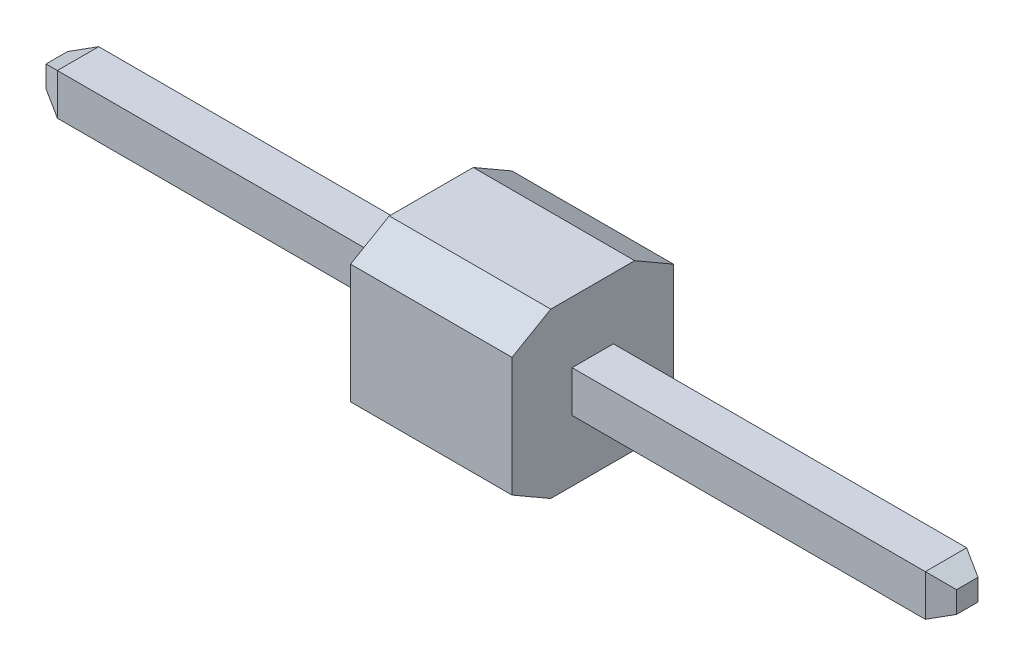
ISO-10303-21;
HEADER;
FILE_DESCRIPTION(('STEP AP214'),'2;1');
FILE_NAME('part.step','',(''),(''),'','','');
FILE_SCHEMA(('AUTOMOTIVE_DESIGN { 1 0 10303 214 1 1 1 1 }'));
ENDSEC;
DATA;
#1=APPLICATION_CONTEXT('core data for automotive mechanical design processes');
#2=APPLICATION_PROTOCOL_DEFINITION('international standard','automotive_design',2000,#1);
#3=PRODUCT_CONTEXT('',#1,'mechanical');
#4=PRODUCT('Part','Part','',(#3));
#5=PRODUCT_RELATED_PRODUCT_CATEGORY('part','',(#4));
#6=PRODUCT_DEFINITION_FORMATION('','',#4);
#7=PRODUCT_DEFINITION_CONTEXT('part definition',#1,'design');
#8=PRODUCT_DEFINITION('design','',#6,#7);
#9=PRODUCT_DEFINITION_SHAPE('','',#8);
#10=(LENGTH_UNIT() NAMED_UNIT(*) SI_UNIT(.MILLI.,.METRE.));
#11=(NAMED_UNIT(*) PLANE_ANGLE_UNIT() SI_UNIT($,.RADIAN.));
#12=(NAMED_UNIT(*) SI_UNIT($,.STERADIAN.) SOLID_ANGLE_UNIT());
#13=UNCERTAINTY_MEASURE_WITH_UNIT(LENGTH_MEASURE(1.E-05),#10,'distance_accuracy_value','');
#14=(GEOMETRIC_REPRESENTATION_CONTEXT(3) GLOBAL_UNCERTAINTY_ASSIGNED_CONTEXT((#13)) GLOBAL_UNIT_ASSIGNED_CONTEXT((#10,
#11,#12)) REPRESENTATION_CONTEXT('',''));
#15=CARTESIAN_POINT('',(0.,0.,0.));
#16=DIRECTION('',(0.,0.,1.));
#17=DIRECTION('',(1.,0.,0.));
#18=AXIS2_PLACEMENT_3D('',#15,#16,#17);
#19=CARTESIAN_POINT('',(5.42107561170757,-15.5571282629139,0.629998634255617));
#20=DIRECTION('',(1.,4.37113882867379E-08,-4.37113882867379E-08));
#21=DIRECTION('',(-4.37113882867379E-08,1.,0.));
#22=AXIS2_PLACEMENT_3D('',#19,#20,#21);
#23=PLANE('',#22);
#24=DIRECTION('',(1.59994777304464E-08,0.500000000000191,0.866025403784328));
#25=VECTOR('',#24,1.);
#26=CARTESIAN_POINT('',(5.42107548872165,-14.3135384244239,-0.940001365744382));
#27=LINE('',#26,#25);
#28=CARTESIAN_POINT('',(5.42107548872165,-14.3135384244239,-0.940001365744382));
#29=VERTEX_POINT('',#28);
#30=CARTESIAN_POINT('',(5.42107549980641,-13.9671282629139,-0.340001365744383));
#31=VERTEX_POINT('',#30);
#32=EDGE_CURVE('E11',#29,#31,#27,.T.);
#33=ORIENTED_EDGE('',*,*,#32,.T.);
#34=DIRECTION('',(4.37113880134522E-08,0.,0.999999999999999));
#35=VECTOR('',#34,1.);
#36=CARTESIAN_POINT('',(5.42107549980641,-13.9671282629139,-0.340001365744383));
#37=LINE('',#36,#35);
#38=CARTESIAN_POINT('',(5.42107555663122,-13.9671282629139,0.959998634255618));
#39=VERTEX_POINT('',#38);
#40=EDGE_CURVE('E304',#31,#39,#37,.T.);
#41=ORIENTED_EDGE('',*,*,#40,.T.);
#42=DIRECTION('',(5.97108681645513E-08,-0.500000000000186,0.866025403784329));
#43=VECTOR('',#42,1.);
#44=CARTESIAN_POINT('',(5.42107555663122,-13.9671282629139,0.959998634255618));
#45=LINE('',#44,#43);
#46=CARTESIAN_POINT('',(5.42107559800012,-14.3135384244239,1.55999863425562));
#47=VERTEX_POINT('',#46);
#48=EDGE_CURVE('E296',#39,#47,#45,.T.);
#49=ORIENTED_EDGE('',*,*,#48,.T.);
#50=DIRECTION('',(4.37113880007249E-08,-0.999999999999999,0.));
#51=VECTOR('',#50,1.);
#52=CARTESIAN_POINT('',(5.42107559800012,-14.3135384244239,1.55999863425562));
#53=LINE('',#52,#51);
#54=CARTESIAN_POINT('',(5.42107567874291,-16.1607181013939,1.55999863425562));
#55=VERTEX_POINT('',#54);
#56=EDGE_CURVE('E281',#47,#55,#53,.T.);
#57=ORIENTED_EDGE('',*,*,#56,.T.);
#58=DIRECTION('',(1.59994790123059E-08,0.500000000000195,0.866025403784326));
#59=VECTOR('',#58,1.);
#60=CARTESIAN_POINT('',(5.42107566765814,-16.5071282629139,0.959998634255618));
#61=LINE('',#60,#59);
#62=CARTESIAN_POINT('',(5.42107566765814,-16.5071282629139,0.959998634255618));
#63=VERTEX_POINT('',#62);
#64=EDGE_CURVE('E265',#63,#55,#61,.T.);
#65=ORIENTED_EDGE('',*,*,#64,.F.);
#66=DIRECTION('',(4.37113880134522E-08,0.,0.999999999999999));
#67=VECTOR('',#66,1.);
#68=CARTESIAN_POINT('',(5.42107561083334,-16.5071282629139,-0.340001365744383));
#69=LINE('',#68,#67);
#70=CARTESIAN_POINT('',(5.42107561083334,-16.5071282629139,-0.340001365744383));
#71=VERTEX_POINT('',#70);
#72=EDGE_CURVE('E248',#71,#63,#69,.T.);
#73=ORIENTED_EDGE('',*,*,#72,.F.);
#74=DIRECTION('',(5.97108668821451E-08,-0.500000000000186,0.866025403784329));
#75=VECTOR('',#74,1.);
#76=CARTESIAN_POINT('',(5.42107556946444,-16.1607181013939,-0.940001365744382));
#77=LINE('',#76,#75);
#78=CARTESIAN_POINT('',(5.42107556946444,-16.1607181013939,-0.940001365744382));
#79=VERTEX_POINT('',#78);
#80=EDGE_CURVE('E242',#79,#71,#77,.T.);
#81=ORIENTED_EDGE('',*,*,#80,.F.);
#82=DIRECTION('',(4.37113880007249E-08,-0.999999999999999,0.));
#83=VECTOR('',#82,1.);
#84=CARTESIAN_POINT('',(5.42107548872165,-14.3135384244239,-0.940001365744382));
#85=LINE('',#84,#83);
#86=EDGE_CURVE('E236',#29,#79,#85,.T.);
#87=ORIENTED_EDGE('',*,*,#86,.F.);
#88=EDGE_LOOP('',(#33,#41,#49,#57,#65,#73,#81,#87));
#89=FACE_BOUND('',#88,.T.);
#90=DIRECTION('',(-4.37113872875372E-08,0.,-0.999999999999999));
#91=VECTOR('',#90,1.);
#92=CARTESIAN_POINT('',(5.42107558373228,-14.9171282629139,0.629998634255617));
#93=LINE('',#92,#91);
#94=CARTESIAN_POINT('',(5.42107558373228,-14.9171282629139,0.629998634255617));
#95=VERTEX_POINT('',#94);
#96=CARTESIAN_POINT('',(5.42107555575699,-14.9171282629139,-0.0100013657443826));
#97=VERTEX_POINT('',#96);
#98=EDGE_CURVE('E302',#95,#97,#93,.T.);
#99=ORIENTED_EDGE('',*,*,#98,.T.);
#100=DIRECTION('',(-4.37113872875371E-08,0.999999999999999,0.));
#101=VECTOR('',#100,1.);
#102=CARTESIAN_POINT('',(5.42107558373228,-15.5571282629139,-0.0100013657443826));
#103=LINE('',#102,#101);
#104=CARTESIAN_POINT('',(5.42107558373228,-15.5571282629139,-0.0100013657443826));
#105=VERTEX_POINT('',#104);
#106=EDGE_CURVE('E293',#105,#97,#103,.T.);
#107=ORIENTED_EDGE('',*,*,#106,.F.);
#108=DIRECTION('',(-4.37113886753159E-08,0.,-0.999999999999999));
#109=VECTOR('',#108,1.);
#110=CARTESIAN_POINT('',(5.42107561170757,-15.5571282629139,0.629998634255617));
#111=LINE('',#110,#109);
#112=CARTESIAN_POINT('',(5.42107561170757,-15.5571282629139,0.629998634255617));
#113=VERTEX_POINT('',#112);
#114=EDGE_CURVE('E278',#113,#105,#111,.T.);
#115=ORIENTED_EDGE('',*,*,#114,.F.);
#116=DIRECTION('',(-4.37113886753159E-08,0.999999999999999,0.));
#117=VECTOR('',#116,1.);
#118=CARTESIAN_POINT('',(5.42107561170757,-15.5571282629139,0.629998634255617));
#119=LINE('',#118,#117);
#120=EDGE_CURVE('E263',#113,#95,#119,.T.);
#121=ORIENTED_EDGE('',*,*,#120,.T.);
#122=EDGE_LOOP('',(#99,#107,#115,#121));
#123=FACE_BOUND('',#122,.T.);
#124=ADVANCED_FACE('F17',(#89,#123),#23,.T.);
#125=CARTESIAN_POINT('',(2.92107561170757,-15.5571283721924,0.629998743534088));
#126=DIRECTION('',(1.,4.37113882867379E-08,-4.37113882867379E-08));
#127=DIRECTION('',(-4.37113882867379E-08,1.,0.));
#128=AXIS2_PLACEMENT_3D('',#125,#126,#127);
#129=PLANE('',#128);
#130=DIRECTION('',(1.59994783714339E-08,0.500000000000191,0.866025403784328));
#131=VECTOR('',#130,1.);
#132=CARTESIAN_POINT('',(2.92107548872165,-14.3135385337024,-0.940001256465912));
#133=LINE('',#132,#131);
#134=CARTESIAN_POINT('',(2.92107548872165,-14.3135385337024,-0.940001256465912));
#135=VERTEX_POINT('',#134);
#136=CARTESIAN_POINT('',(2.92107549980641,-13.9671283721924,-0.340001256465912));
#137=VERTEX_POINT('',#136);
#138=EDGE_CURVE('E24',#135,#137,#133,.T.);
#139=ORIENTED_EDGE('',*,*,#138,.F.);
#140=DIRECTION('',(4.37113882411396E-08,-0.999999999999999,0.));
#141=VECTOR('',#140,1.);
#142=CARTESIAN_POINT('',(2.92107548872165,-14.3135385337024,-0.940001256465912));
#143=LINE('',#142,#141);
#144=CARTESIAN_POINT('',(2.92107556946444,-16.1607182106724,-0.940001256465912));
#145=VERTEX_POINT('',#144);
#146=EDGE_CURVE('E300',#135,#145,#143,.T.);
#147=ORIENTED_EDGE('',*,*,#146,.T.);
#148=DIRECTION('',(5.97108668821451E-08,-0.500000000000186,0.866025403784329));
#149=VECTOR('',#148,1.);
#150=CARTESIAN_POINT('',(2.92107556946444,-16.1607182106724,-0.940001256465912));
#151=LINE('',#150,#149);
#152=CARTESIAN_POINT('',(2.92107561083334,-16.5071283721924,-0.340001256465912));
#153=VERTEX_POINT('',#152);
#154=EDGE_CURVE('E286',#145,#153,#151,.T.);
#155=ORIENTED_EDGE('',*,*,#154,.T.);
#156=DIRECTION('',(4.37113883550593E-08,0.,0.999999999999999));
#157=VECTOR('',#156,1.);
#158=CARTESIAN_POINT('',(2.92107561083334,-16.5071283721924,-0.340001256465912));
#159=LINE('',#158,#157);
#160=CARTESIAN_POINT('',(2.92107566765814,-16.5071283721924,0.959998743534088));
#161=VERTEX_POINT('',#160);
#162=EDGE_CURVE('E271',#153,#161,#159,.T.);
#163=ORIENTED_EDGE('',*,*,#162,.T.);
#164=DIRECTION('',(1.59994783713184E-08,0.500000000000195,0.866025403784326));
#165=VECTOR('',#164,1.);
#166=CARTESIAN_POINT('',(2.92107566765814,-16.5071283721924,0.959998743534088));
#167=LINE('',#166,#165);
#168=CARTESIAN_POINT('',(2.92107567874291,-16.1607182106724,1.55999874353409));
#169=VERTEX_POINT('',#168);
#170=EDGE_CURVE('E253',#161,#169,#167,.T.);
#171=ORIENTED_EDGE('',*,*,#170,.T.);
#172=DIRECTION('',(4.37113882411396E-08,-0.999999999999999,0.));
#173=VECTOR('',#172,1.);
#174=CARTESIAN_POINT('',(2.92107559800012,-14.3135385337024,1.55999874353409));
#175=LINE('',#174,#173);
#176=CARTESIAN_POINT('',(2.92107559800012,-14.3135385337024,1.55999874353409));
#177=VERTEX_POINT('',#176);
#178=EDGE_CURVE('E261',#177,#169,#175,.T.);
#179=ORIENTED_EDGE('',*,*,#178,.F.);
#180=DIRECTION('',(5.97108668825762E-08,-0.500000000000186,0.866025403784329));
#181=VECTOR('',#180,1.);
#182=CARTESIAN_POINT('',(2.92107555663122,-13.9671283721924,0.959998743534088));
#183=LINE('',#182,#181);
#184=CARTESIAN_POINT('',(2.92107555663122,-13.9671283721924,0.959998743534088));
#185=VERTEX_POINT('',#184);
#186=EDGE_CURVE('E276',#185,#177,#183,.T.);
#187=ORIENTED_EDGE('',*,*,#186,.F.);
#188=DIRECTION('',(4.37113883550593E-08,0.,0.999999999999999));
#189=VECTOR('',#188,1.);
#190=CARTESIAN_POINT('',(2.92107549980641,-13.9671283721924,-0.340001256465912));
#191=LINE('',#190,#189);
#192=EDGE_CURVE('E291',#137,#185,#191,.T.);
#193=ORIENTED_EDGE('',*,*,#192,.F.);
#194=EDGE_LOOP('',(#139,#147,#155,#163,#171,#179,#187,#193));
#195=FACE_BOUND('',#194,.T.);
#196=DIRECTION('',(-4.37113886753159E-08,0.999999999999999,0.));
#197=VECTOR('',#196,1.);
#198=CARTESIAN_POINT('',(2.92107558373228,-15.5571283721924,-0.0100012564659119));
#199=LINE('',#198,#197);
#200=CARTESIAN_POINT('',(2.92107558373228,-15.5571283721924,-0.0100012564659119));
#201=VERTEX_POINT('',#200);
#202=CARTESIAN_POINT('',(2.92107555575699,-14.9171283721924,-0.0100012564659119));
#203=VERTEX_POINT('',#202);
#204=EDGE_CURVE('E298',#201,#203,#199,.T.);
#205=ORIENTED_EDGE('',*,*,#204,.T.);
#206=DIRECTION('',(-4.37113886753159E-08,0.,-0.999999999999999));
#207=VECTOR('',#206,1.);
#208=CARTESIAN_POINT('',(2.92107558373228,-14.9171283721924,0.629998743534088));
#209=LINE('',#208,#207);
#210=CARTESIAN_POINT('',(2.92107558373228,-14.9171283721924,0.629998743534088));
#211=VERTEX_POINT('',#210);
#212=EDGE_CURVE('E283',#211,#203,#209,.T.);
#213=ORIENTED_EDGE('',*,*,#212,.F.);
#214=DIRECTION('',(-4.37113879814265E-08,0.999999999999999,0.));
#215=VECTOR('',#214,1.);
#216=CARTESIAN_POINT('',(2.92107561170757,-15.5571283721924,0.629998743534088));
#217=LINE('',#216,#215);
#218=CARTESIAN_POINT('',(2.92107561170757,-15.5571283721924,0.629998743534088));
#219=VERTEX_POINT('',#218);
#220=EDGE_CURVE('E268',#219,#211,#217,.T.);
#221=ORIENTED_EDGE('',*,*,#220,.F.);
#222=DIRECTION('',(-4.37113879814266E-08,0.,-0.999999999999999));
#223=VECTOR('',#222,1.);
#224=CARTESIAN_POINT('',(2.92107561170757,-15.5571283721924,0.629998743534088));
#225=LINE('',#224,#223);
#226=EDGE_CURVE('E251',#219,#201,#225,.T.);
#227=ORIENTED_EDGE('',*,*,#226,.T.);
#228=EDGE_LOOP('',(#205,#213,#221,#227));
#229=FACE_BOUND('',#228,.T.);
#230=ADVANCED_FACE('F314',(#195,#229),#129,.F.);
#231=CARTESIAN_POINT('',(5.42107548872165,-14.3135384244239,-0.940001365744382));
#232=DIRECTION('',(5.97108668343731E-08,-0.866025403784328,0.50000000000019));
#233=DIRECTION('',(-1.59994785476185E-08,-0.500000000000192,-0.866025403784329));
#234=AXIS2_PLACEMENT_3D('',#231,#232,#233);
#235=PLANE('',#234);
#236=ORIENTED_EDGE('',*,*,#138,.T.);
#237=DIRECTION('',(-0.999999999999998,-4.37113854445669E-08,4.37113883755557E-08));
#238=VECTOR('',#237,1.);
#239=CARTESIAN_POINT('',(5.42107549980641,-13.9671282629139,-0.340001365744383));
#240=LINE('',#239,#238);
#241=EDGE_CURVE('E288',#31,#137,#240,.T.);
#242=ORIENTED_EDGE('',*,*,#241,.F.);
#243=ORIENTED_EDGE('',*,*,#32,.F.);
#244=DIRECTION('',(-0.999999999999998,-4.37113897078233E-08,4.37113881091021E-08));
#245=VECTOR('',#244,1.);
#246=CARTESIAN_POINT('',(5.42107548872165,-14.3135384244239,-0.940001365744382));
#247=LINE('',#246,#245);
#248=EDGE_CURVE('E256',#29,#135,#247,.T.);
#249=ORIENTED_EDGE('',*,*,#248,.T.);
#250=EDGE_LOOP('',(#236,#242,#243,#249));
#251=FACE_BOUND('',#250,.T.);
#252=ADVANCED_FACE('F306',(#251),#235,.F.);
#253=CARTESIAN_POINT('',(5.42107549980641,-13.9671282629139,-0.340001365744383));
#254=DIRECTION('',(4.37113882867379E-08,-1.,0.));
#255=DIRECTION('',(1.,4.37113882867379E-08,-4.37113882867379E-08));
#256=AXIS2_PLACEMENT_3D('',#253,#254,#255);
#257=PLANE('',#256);
#258=ORIENTED_EDGE('',*,*,#192,.T.);
#259=DIRECTION('',(-0.999999999999998,-4.37113854445669E-08,4.37113882867378E-08));
#260=VECTOR('',#259,1.);
#261=CARTESIAN_POINT('',(5.42107555663122,-13.9671282629139,0.959998634255618));
#262=LINE('',#261,#260);
#263=EDGE_CURVE('E273',#39,#185,#262,.T.);
#264=ORIENTED_EDGE('',*,*,#263,.F.);
#265=ORIENTED_EDGE('',*,*,#40,.F.);
#266=ORIENTED_EDGE('',*,*,#241,.T.);
#267=EDGE_LOOP('',(#258,#264,#265,#266));
#268=FACE_BOUND('',#267,.T.);
#269=ADVANCED_FACE('F311',(#268),#257,.F.);
#270=CARTESIAN_POINT('',(5.42107555663122,-13.9671282629139,0.959998634255618));
#271=DIRECTION('',(1.59994785476185E-08,-0.86602540378433,-0.50000000000019));
#272=DIRECTION('',(-5.97108668343731E-08,0.500000000000188,-0.866025403784329));
#273=AXIS2_PLACEMENT_3D('',#270,#271,#272);
#274=PLANE('',#273);
#275=ORIENTED_EDGE('',*,*,#186,.T.);
#276=DIRECTION('',(-0.999999999999998,-4.37113897078233E-08,4.37113882867378E-08));
#277=VECTOR('',#276,1.);
#278=CARTESIAN_POINT('',(5.42107559800012,-14.3135384244239,1.55999863425562));
#279=LINE('',#278,#277);
#280=EDGE_CURVE('E258',#47,#177,#279,.T.);
#281=ORIENTED_EDGE('',*,*,#280,.F.);
#282=ORIENTED_EDGE('',*,*,#48,.F.);
#283=ORIENTED_EDGE('',*,*,#263,.T.);
#284=EDGE_LOOP('',(#275,#281,#282,#283));
#285=FACE_BOUND('',#284,.T.);
#286=ADVANCED_FACE('F319',(#285),#274,.F.);
#287=CARTESIAN_POINT('',(5.42107559800012,-14.3135384244239,1.55999863425562));
#288=DIRECTION('',(-4.37113882867379E-08,0.,-1.));
#289=DIRECTION('',(-1.,-4.37113882867379E-08,4.37113882867379E-08));
#290=AXIS2_PLACEMENT_3D('',#287,#288,#289);
#291=PLANE('',#290);
#292=ORIENTED_EDGE('',*,*,#178,.T.);
#293=DIRECTION('',(-0.999999999999998,-4.37113897078233E-08,4.37113882867378E-08));
#294=VECTOR('',#293,1.);
#295=CARTESIAN_POINT('',(5.42107567874291,-16.1607181013939,1.55999863425562));
#296=LINE('',#295,#294);
#297=EDGE_CURVE('E245',#55,#169,#296,.T.);
#298=ORIENTED_EDGE('',*,*,#297,.F.);
#299=ORIENTED_EDGE('',*,*,#56,.F.);
#300=ORIENTED_EDGE('',*,*,#280,.T.);
#301=EDGE_LOOP('',(#292,#298,#299,#300));
#302=FACE_BOUND('',#301,.T.);
#303=ADVANCED_FACE('F326',(#302),#291,.F.);
#304=CARTESIAN_POINT('',(5.42107566765814,-16.5071282629139,0.959998634255618));
#305=DIRECTION('',(5.97108668343731E-08,-0.866025403784328,0.50000000000019));
#306=DIRECTION('',(-1.59994785476185E-08,-0.500000000000192,-0.866025403784329));
#307=AXIS2_PLACEMENT_3D('',#304,#305,#306);
#308=PLANE('',#307);
#309=ORIENTED_EDGE('',*,*,#170,.F.);
#310=DIRECTION('',(-0.999999999999998,-4.37113854445669E-08,4.37113882867378E-08));
#311=VECTOR('',#310,1.);
#312=CARTESIAN_POINT('',(5.42107566765814,-16.5071282629139,0.959998634255618));
#313=LINE('',#312,#311);
#314=EDGE_CURVE('E239',#63,#161,#313,.T.);
#315=ORIENTED_EDGE('',*,*,#314,.F.);
#316=ORIENTED_EDGE('',*,*,#64,.T.);
#317=ORIENTED_EDGE('',*,*,#297,.T.);
#318=EDGE_LOOP('',(#309,#315,#316,#317));
#319=FACE_BOUND('',#318,.T.);
#320=ADVANCED_FACE('F329',(#319),#308,.T.);
#321=CARTESIAN_POINT('',(5.42107561083334,-16.5071282629139,-0.340001365744383));
#322=DIRECTION('',(4.37113882867379E-08,-1.,0.));
#323=DIRECTION('',(1.,4.37113882867379E-08,-4.37113882867379E-08));
#324=AXIS2_PLACEMENT_3D('',#321,#322,#323);
#325=PLANE('',#324);
#326=ORIENTED_EDGE('',*,*,#162,.F.);
#327=DIRECTION('',(-0.999999999999998,-4.37113854445669E-08,4.37113883755557E-08));
#328=VECTOR('',#327,1.);
#329=CARTESIAN_POINT('',(5.42107561083334,-16.5071282629139,-0.340001365744383));
#330=LINE('',#329,#328);
#331=EDGE_CURVE('E233',#71,#153,#330,.T.);
#332=ORIENTED_EDGE('',*,*,#331,.F.);
#333=ORIENTED_EDGE('',*,*,#72,.T.);
#334=ORIENTED_EDGE('',*,*,#314,.T.);
#335=EDGE_LOOP('',(#326,#332,#333,#334));
#336=FACE_BOUND('',#335,.T.);
#337=ADVANCED_FACE('F333',(#336),#325,.T.);
#338=CARTESIAN_POINT('',(5.42107556946444,-16.1607181013939,-0.940001365744382));
#339=DIRECTION('',(1.59994785476185E-08,-0.86602540378433,-0.50000000000019));
#340=DIRECTION('',(-5.97108668343731E-08,0.500000000000188,-0.866025403784329));
#341=AXIS2_PLACEMENT_3D('',#338,#339,#340);
#342=PLANE('',#341);
#343=ORIENTED_EDGE('',*,*,#154,.F.);
#344=DIRECTION('',(-0.999999999999998,-4.37113897078233E-08,4.37113881091022E-08));
#345=VECTOR('',#344,1.);
#346=CARTESIAN_POINT('',(5.42107556946444,-16.1607181013939,-0.940001365744382));
#347=LINE('',#346,#345);
#348=EDGE_CURVE('E230',#79,#145,#347,.T.);
#349=ORIENTED_EDGE('',*,*,#348,.F.);
#350=ORIENTED_EDGE('',*,*,#80,.T.);
#351=ORIENTED_EDGE('',*,*,#331,.T.);
#352=EDGE_LOOP('',(#343,#349,#350,#351));
#353=FACE_BOUND('',#352,.T.);
#354=ADVANCED_FACE('F337',(#353),#342,.T.);
#355=CARTESIAN_POINT('',(5.42107548872165,-14.3135384244239,-0.940001365744382));
#356=DIRECTION('',(-4.37113882867379E-08,0.,-1.));
#357=DIRECTION('',(-4.37113882867379E-08,1.,0.));
#358=AXIS2_PLACEMENT_3D('',#355,#356,#357);
#359=PLANE('',#358);
#360=ORIENTED_EDGE('',*,*,#146,.F.);
#361=ORIENTED_EDGE('',*,*,#248,.F.);
#362=ORIENTED_EDGE('',*,*,#86,.T.);
#363=ORIENTED_EDGE('',*,*,#348,.T.);
#364=EDGE_LOOP('',(#360,#361,#362,#363));
#365=FACE_BOUND('',#364,.T.);
#366=ADVANCED_FACE('F339',(#365),#359,.T.);
#367=CARTESIAN_POINT('',(-2.87892438829243,-15.5571286257184,0.62999899706014));
#368=DIRECTION('',(-1.,-4.37113882867379E-08,4.37113882867379E-08));
#369=DIRECTION('',(4.37113882867379E-08,-1.,0.));
#370=AXIS2_PLACEMENT_3D('',#367,#368,#369);
#371=PLANE('',#370);
#372=DIRECTION('',(4.3711384729096E-08,-0.999999999999999,0.));
#373=VECTOR('',#372,1.);
#374=CARTESIAN_POINT('',(-2.87892443079026,-15.0710101529084,0.14388052425114));
#375=LINE('',#374,#373);
#376=CARTESIAN_POINT('',(-2.87892443079026,-15.0710101529084,0.14388052425114));
#377=VERTEX_POINT('',#376);
#378=CARTESIAN_POINT('',(-2.87892441626772,-15.4032470985184,0.14388052425114));
#379=VERTEX_POINT('',#378);
#380=EDGE_CURVE('E228',#377,#379,#375,.T.);
#381=ORIENTED_EDGE('',*,*,#380,.T.);
#382=DIRECTION('',(4.37113900746999E-08,0.,0.999999999999999));
#383=VECTOR('',#382,1.);
#384=CARTESIAN_POINT('',(-2.87892441626772,-15.4032470985184,0.14388052425114));
#385=LINE('',#384,#383);
#386=CARTESIAN_POINT('',(-2.87892440174518,-15.4032470985184,0.47611746986914));
#387=VERTEX_POINT('',#386);
#388=EDGE_CURVE('E223',#379,#387,#385,.T.);
#389=ORIENTED_EDGE('',*,*,#388,.T.);
#390=DIRECTION('',(-4.37113874024243E-08,0.999999999999999,0.));
#391=VECTOR('',#390,1.);
#392=CARTESIAN_POINT('',(-2.87892440174519,-15.4032470985184,0.47611746986914));
#393=LINE('',#392,#391);
#394=CARTESIAN_POINT('',(-2.87892441626772,-15.0710101529084,0.47611746986914));
#395=VERTEX_POINT('',#394);
#396=EDGE_CURVE('E215',#387,#395,#393,.T.);
#397=ORIENTED_EDGE('',*,*,#396,.T.);
#398=DIRECTION('',(-4.37113820547151E-08,0.,-0.999999999999999));
#399=VECTOR('',#398,1.);
#400=CARTESIAN_POINT('',(-2.87892441626772,-15.0710101529084,0.47611746986914));
#401=LINE('',#400,#399);
#402=EDGE_CURVE('E207',#395,#377,#401,.T.);
#403=ORIENTED_EDGE('',*,*,#402,.T.);
#404=EDGE_LOOP('',(#381,#389,#397,#403));
#405=FACE_BOUND('',#404,.T.);
#406=ADVANCED_FACE('F341',(#405),#371,.T.);
#407=CARTESIAN_POINT('',(-2.87892438829243,-15.5571286257184,0.62999899706014));
#408=DIRECTION('',(4.37113882867379E-08,-1.,0.));
#409=DIRECTION('',(-4.37113882867379E-08,0.,-1.));
#410=AXIS2_PLACEMENT_3D('',#407,#408,#409);
#411=PLANE('',#410);
#412=DIRECTION('',(0.999999999999998,4.37113888452998E-08,-4.37113882769955E-08));
#413=VECTOR('',#412,1.);
#414=CARTESIAN_POINT('',(-2.54892438829243,-15.5571286112937,0.629998982635382));
#415=LINE('',#414,#413);
#416=CARTESIAN_POINT('',(-2.54892438829243,-15.5571286112937,0.629998982635382));
#417=VERTEX_POINT('',#416);
#418=EDGE_CURVE('E225',#417,#219,#415,.T.);
#419=ORIENTED_EDGE('',*,*,#418,.F.);
#420=DIRECTION('',(-4.37113886753159E-08,0.,-0.999999999999999));
#421=VECTOR('',#420,1.);
#422=CARTESIAN_POINT('',(-2.54892438829243,-15.5571286112937,0.629998982635382));
#423=LINE('',#422,#421);
#424=CARTESIAN_POINT('',(-2.54892441626772,-15.5571286112937,-0.010001017364618));
#425=VERTEX_POINT('',#424);
#426=EDGE_CURVE('E217',#417,#425,#423,.T.);
#427=ORIENTED_EDGE('',*,*,#426,.T.);
#428=DIRECTION('',(0.999999999999998,4.37113888452998E-08,-4.37113882161057E-08));
#429=VECTOR('',#428,1.);
#430=CARTESIAN_POINT('',(-2.54892441626772,-15.5571286112937,-0.010001017364618));
#431=LINE('',#430,#429);
#432=EDGE_CURVE('E220',#425,#201,#431,.T.);
#433=ORIENTED_EDGE('',*,*,#432,.T.);
#434=ORIENTED_EDGE('',*,*,#226,.F.);
#435=EDGE_LOOP('',(#419,#427,#433,#434));
#436=FACE_BOUND('',#435,.T.);
#437=ADVANCED_FACE('F348',(#436),#411,.T.);
#438=CARTESIAN_POINT('',(-2.87892441626772,-15.5571286257184,-0.0100010029398598));
#439=DIRECTION('',(-4.37113882867379E-08,0.,-1.));
#440=DIRECTION('',(-1.,-4.37113882867379E-08,4.37113882867379E-08));
#441=AXIS2_PLACEMENT_3D('',#438,#439,#440);
#442=PLANE('',#441);
#443=ORIENTED_EDGE('',*,*,#432,.F.);
#444=DIRECTION('',(-4.37113872875371E-08,0.999999999999999,0.));
#445=VECTOR('',#444,1.);
#446=CARTESIAN_POINT('',(-2.54892441626772,-15.5571286112937,-0.010001017364618));
#447=LINE('',#446,#445);
#448=CARTESIAN_POINT('',(-2.54892444424301,-14.9171286112937,-0.010001017364618));
#449=VERTEX_POINT('',#448);
#450=EDGE_CURVE('E209',#425,#449,#447,.T.);
#451=ORIENTED_EDGE('',*,*,#450,.T.);
#452=DIRECTION('',(0.999999999999998,4.37113855978467E-08,-4.37113882161058E-08));
#453=VECTOR('',#452,1.);
#454=CARTESIAN_POINT('',(-2.54892444424301,-14.9171286112937,-0.010001017364618));
#455=LINE('',#454,#453);
#456=EDGE_CURVE('E212',#449,#203,#455,.T.);
#457=ORIENTED_EDGE('',*,*,#456,.T.);
#458=ORIENTED_EDGE('',*,*,#204,.F.);
#459=EDGE_LOOP('',(#443,#451,#457,#458));
#460=FACE_BOUND('',#459,.T.);
#461=ADVANCED_FACE('F424',(#460),#442,.T.);
#462=CARTESIAN_POINT('',(-2.87892441626772,-14.9171286257184,0.62999899706014));
#463=DIRECTION('',(4.37113882867379E-08,-1.,0.));
#464=DIRECTION('',(-4.37113882867379E-08,0.,-1.));
#465=AXIS2_PLACEMENT_3D('',#462,#463,#464);
#466=PLANE('',#465);
#467=ORIENTED_EDGE('',*,*,#456,.F.);
#468=DIRECTION('',(4.37113886753159E-08,0.,0.999999999999999));
#469=VECTOR('',#468,1.);
#470=CARTESIAN_POINT('',(-2.54892444424301,-14.9171286112937,-0.010001017364618));
#471=LINE('',#470,#469);
#472=CARTESIAN_POINT('',(-2.54892441626772,-14.9171286112937,0.629998982635382));
#473=VERTEX_POINT('',#472);
#474=EDGE_CURVE('E201',#449,#473,#471,.T.);
#475=ORIENTED_EDGE('',*,*,#474,.T.);
#476=DIRECTION('',(0.999999999999998,4.37113855978467E-08,-4.37113882769955E-08));
#477=VECTOR('',#476,1.);
#478=CARTESIAN_POINT('',(-2.54892441626772,-14.9171286112937,0.629998982635382));
#479=LINE('',#478,#477);
#480=EDGE_CURVE('E204',#473,#211,#479,.T.);
#481=ORIENTED_EDGE('',*,*,#480,.T.);
#482=ORIENTED_EDGE('',*,*,#212,.T.);
#483=EDGE_LOOP('',(#467,#475,#481,#482));
#484=FACE_BOUND('',#483,.T.);
#485=ADVANCED_FACE('F421',(#484),#466,.F.);
#486=CARTESIAN_POINT('',(-2.87892438829243,-15.5571286257184,0.62999899706014));
#487=DIRECTION('',(-4.37113882867379E-08,0.,-1.));
#488=DIRECTION('',(-1.,-4.37113882867379E-08,4.37113882867379E-08));
#489=AXIS2_PLACEMENT_3D('',#486,#487,#488);
#490=PLANE('',#489);
#491=ORIENTED_EDGE('',*,*,#480,.F.);
#492=DIRECTION('',(4.37113872875371E-08,-0.999999999999999,0.));
#493=VECTOR('',#492,1.);
#494=CARTESIAN_POINT('',(-2.54892441626772,-14.9171286112937,0.629998982635382));
#495=LINE('',#494,#493);
#496=EDGE_CURVE('E196',#473,#417,#495,.T.);
#497=ORIENTED_EDGE('',*,*,#496,.T.);
#498=ORIENTED_EDGE('',*,*,#418,.T.);
#499=ORIENTED_EDGE('',*,*,#220,.T.);
#500=EDGE_LOOP('',(#491,#497,#498,#499));
#501=FACE_BOUND('',#500,.T.);
#502=ADVANCED_FACE('F376',(#501),#490,.F.);
#503=CARTESIAN_POINT('',(-2.87892438829243,-15.5571286257184,0.62999899706014));
#504=DIRECTION('',(-4.37113882867379E-08,0.,-1.));
#505=DIRECTION('',(-1.,-4.37113882867379E-08,4.37113882867379E-08));
#506=AXIS2_PLACEMENT_3D('',#503,#504,#505);
#507=PLANE('',#506);
#508=DIRECTION('',(0.999999999999998,4.37113829998842E-08,-4.37113882769955E-08));
#509=VECTOR('',#508,1.);
#510=CARTESIAN_POINT('',(5.42107561170757,-15.5571282629139,0.629998634255617));
#511=LINE('',#510,#509);
#512=CARTESIAN_POINT('',(10.8910756117076,-15.5571280238126,0.629998395154324));
#513=VERTEX_POINT('',#512);
#514=EDGE_CURVE('E199',#113,#513,#511,.T.);
#515=ORIENTED_EDGE('',*,*,#514,.T.);
#516=DIRECTION('',(-4.37113900630947E-08,0.999999999999999,0.));
#517=VECTOR('',#516,1.);
#518=CARTESIAN_POINT('',(10.8910756117076,-15.5571280238126,0.629998395154324));
#519=LINE('',#518,#517);
#520=CARTESIAN_POINT('',(10.8910755837323,-14.9171280238126,0.629998395154324));
#521=VERTEX_POINT('',#520);
#522=EDGE_CURVE('E191',#513,#521,#519,.T.);
#523=ORIENTED_EDGE('',*,*,#522,.T.);
#524=DIRECTION('',(0.999999999999998,4.37113881958092E-08,-4.37113882769955E-08));
#525=VECTOR('',#524,1.);
#526=CARTESIAN_POINT('',(5.42107558373228,-14.9171282629139,0.629998634255617));
#527=LINE('',#526,#525);
#528=EDGE_CURVE('E194',#95,#521,#527,.T.);
#529=ORIENTED_EDGE('',*,*,#528,.F.);
#530=ORIENTED_EDGE('',*,*,#120,.F.);
#531=EDGE_LOOP('',(#515,#523,#529,#530));
#532=FACE_BOUND('',#531,.T.);
#533=ADVANCED_FACE('F367',(#532),#507,.F.);
#534=CARTESIAN_POINT('',(-2.87892441626772,-14.9171286257184,0.62999899706014));
#535=DIRECTION('',(4.37113882867379E-08,-1.,0.));
#536=DIRECTION('',(-4.37113882867379E-08,0.,-1.));
#537=AXIS2_PLACEMENT_3D('',#534,#535,#536);
#538=PLANE('',#537);
#539=ORIENTED_EDGE('',*,*,#528,.T.);
#540=DIRECTION('',(-4.37113900630947E-08,0.,-0.999999999999999));
#541=VECTOR('',#540,1.);
#542=CARTESIAN_POINT('',(10.8910755837323,-14.9171280238126,0.629998395154324));
#543=LINE('',#542,#541);
#544=CARTESIAN_POINT('',(10.891075555757,-14.9171280238126,-0.0100016048456765));
#545=VERTEX_POINT('',#544);
#546=EDGE_CURVE('E186',#521,#545,#543,.T.);
#547=ORIENTED_EDGE('',*,*,#546,.T.);
#548=DIRECTION('',(0.999999999999998,4.37113881958092E-08,-4.37113881146228E-08));
#549=VECTOR('',#548,1.);
#550=CARTESIAN_POINT('',(5.42107555575699,-14.9171282629139,-0.0100013657443823));
#551=LINE('',#550,#549);
#552=EDGE_CURVE('E189',#97,#545,#551,.T.);
#553=ORIENTED_EDGE('',*,*,#552,.F.);
#554=ORIENTED_EDGE('',*,*,#98,.F.);
#555=EDGE_LOOP('',(#539,#547,#553,#554));
#556=FACE_BOUND('',#555,.T.);
#557=ADVANCED_FACE('F364',(#556),#538,.F.);
#558=CARTESIAN_POINT('',(-2.87892441626772,-15.5571286257184,-0.0100010029398598));
#559=DIRECTION('',(-4.37113882867379E-08,0.,-1.));
#560=DIRECTION('',(-1.,-4.37113882867379E-08,4.37113882867379E-08));
#561=AXIS2_PLACEMENT_3D('',#558,#559,#560);
#562=PLANE('',#561);
#563=ORIENTED_EDGE('',*,*,#552,.T.);
#564=DIRECTION('',(4.37113900630947E-08,-0.999999999999999,0.));
#565=VECTOR('',#564,1.);
#566=CARTESIAN_POINT('',(10.891075555757,-14.9171280238126,-0.0100016048456764));
#567=LINE('',#566,#565);
#568=CARTESIAN_POINT('',(10.8910755837323,-15.5571280238126,-0.0100016048456765));
#569=VERTEX_POINT('',#568);
#570=EDGE_CURVE('E176',#545,#569,#567,.T.);
#571=ORIENTED_EDGE('',*,*,#570,.T.);
#572=DIRECTION('',(0.999999999999998,4.37113829998842E-08,-4.37113881146228E-08));
#573=VECTOR('',#572,1.);
#574=CARTESIAN_POINT('',(5.42107558373228,-15.5571282629139,-0.0100013657443823));
#575=LINE('',#574,#573);
#576=EDGE_CURVE('E179',#105,#569,#575,.T.);
#577=ORIENTED_EDGE('',*,*,#576,.F.);
#578=ORIENTED_EDGE('',*,*,#106,.T.);
#579=EDGE_LOOP('',(#563,#571,#577,#578));
#580=FACE_BOUND('',#579,.T.);
#581=ADVANCED_FACE('F366',(#580),#562,.T.);
#582=CARTESIAN_POINT('',(-2.87892438829243,-15.5571286257184,0.62999899706014));
#583=DIRECTION('',(4.37113882867379E-08,-1.,0.));
#584=DIRECTION('',(-4.37113882867379E-08,0.,-1.));
#585=AXIS2_PLACEMENT_3D('',#582,#583,#584);
#586=PLANE('',#585);
#587=ORIENTED_EDGE('',*,*,#576,.T.);
#588=DIRECTION('',(4.37113872875372E-08,0.,0.999999999999999));
#589=VECTOR('',#588,1.);
#590=CARTESIAN_POINT('',(10.8910755837323,-15.5571280238126,-0.0100016048456765));
#591=LINE('',#590,#589);
#592=EDGE_CURVE('E167',#569,#513,#591,.T.);
#593=ORIENTED_EDGE('',*,*,#592,.T.);
#594=ORIENTED_EDGE('',*,*,#514,.F.);
#595=ORIENTED_EDGE('',*,*,#114,.T.);
#596=EDGE_LOOP('',(#587,#593,#594,#595));
#597=FACE_BOUND('',#596,.T.);
#598=ADVANCED_FACE('F373',(#597),#586,.T.);
#599=CARTESIAN_POINT('',(11.2210756117076,-15.5571280093879,0.629998380729565));
#600=DIRECTION('',(-1.,-4.37113882867379E-08,4.37113882867379E-08));
#601=DIRECTION('',(4.37113882867379E-08,-1.,0.));
#602=AXIS2_PLACEMENT_3D('',#599,#600,#601);
#603=PLANE('',#602);
#604=DIRECTION('',(-4.37113874024243E-08,0.999999999999999,0.));
#605=VECTOR('',#604,1.);
#606=CARTESIAN_POINT('',(11.2210755837323,-15.4032464821879,0.143879907920565));
#607=LINE('',#606,#605);
#608=CARTESIAN_POINT('',(11.2210755837323,-15.4032464821879,0.143879907920565));
#609=VERTEX_POINT('',#608);
#610=CARTESIAN_POINT('',(11.2210755692097,-15.0710095365779,0.143879907920565));
#611=VERTEX_POINT('',#610);
#612=EDGE_CURVE('E153',#609,#611,#607,.T.);
#613=ORIENTED_EDGE('',*,*,#612,.T.);
#614=DIRECTION('',(4.37113874013716E-08,0.,0.999999999999999));
#615=VECTOR('',#614,1.);
#616=CARTESIAN_POINT('',(11.2210755692097,-15.0710095365779,0.143879907920565));
#617=LINE('',#616,#615);
#618=CARTESIAN_POINT('',(11.2210755837323,-15.0710095365779,0.476116853538565));
#619=VERTEX_POINT('',#618);
#620=EDGE_CURVE('E395',#611,#619,#617,.T.);
#621=ORIENTED_EDGE('',*,*,#620,.T.);
#622=DIRECTION('',(4.37113874024243E-08,-0.999999999999999,0.));
#623=VECTOR('',#622,1.);
#624=CARTESIAN_POINT('',(11.2210755837323,-15.0710095365779,0.476116853538565));
#625=LINE('',#624,#623);
#626=CARTESIAN_POINT('',(11.2210755982548,-15.4032464821879,0.476116853538565));
#627=VERTEX_POINT('',#626);
#628=EDGE_CURVE('E156',#619,#627,#625,.T.);
#629=ORIENTED_EDGE('',*,*,#628,.T.);
#630=DIRECTION('',(-4.37113927480282E-08,0.,-0.999999999999999));
#631=VECTOR('',#630,1.);
#632=CARTESIAN_POINT('',(11.2210755982548,-15.4032464821879,0.476116853538565));
#633=LINE('',#632,#631);
#634=EDGE_CURVE('E149',#627,#609,#633,.T.);
#635=ORIENTED_EDGE('',*,*,#634,.T.);
#636=EDGE_LOOP('',(#613,#621,#629,#635));
#637=FACE_BOUND('',#636,.T.);
#638=ADVANCED_FACE('F151',(#637),#603,.F.);
#639=CARTESIAN_POINT('',(-2.87892440954135,-15.0710101529084,0.62999899706014));
#640=DIRECTION('',(-0.422618301356784,0.906307768563367,1.84732310895534E-08));
#641=DIRECTION('',(4.37113882867379E-08,0.,1.));
#642=AXIS2_PLACEMENT_3D('',#639,#640,#641);
#643=PLANE('',#642);
#644=DIRECTION('',(0.834817095446925,0.389281657126021,-0.389281657126018));
#645=VECTOR('',#644,1.);
#646=CARTESIAN_POINT('',(-2.87892443079028,-15.0710101529079,0.143880524251623));
#647=LINE('',#646,#645);
#648=EDGE_CURVE('E181',#377,#449,#647,.T.);
#649=ORIENTED_EDGE('',*,*,#648,.F.);
#650=ORIENTED_EDGE('',*,*,#402,.F.);
#651=DIRECTION('',(-0.834817129479006,-0.389281657126021,-0.389281584143986));
#652=VECTOR('',#651,1.);
#653=CARTESIAN_POINT('',(-2.54892441626815,-14.9171286112922,0.629998982634844));
#654=LINE('',#653,#652);
#655=EDGE_CURVE('E404',#473,#395,#654,.T.);
#656=ORIENTED_EDGE('',*,*,#655,.F.);
#657=ORIENTED_EDGE('',*,*,#474,.F.);
#658=EDGE_LOOP('',(#649,#650,#656,#657));
#659=FACE_BOUND('',#658,.T.);
#660=ADVANCED_FACE('F418',(#659),#643,.T.);
#661=CARTESIAN_POINT('',(-2.87892439501881,-15.5571286257184,0.47611746986914));
#662=DIRECTION('',(-0.422618222124841,-1.84732292043498E-08,0.906307805509828));
#663=DIRECTION('',(4.37113882867379E-08,-1.,0.));
#664=AXIS2_PLACEMENT_3D('',#661,#662,#663);
#665=PLANE('',#664);
#666=ORIENTED_EDGE('',*,*,#655,.T.);
#667=ORIENTED_EDGE('',*,*,#396,.F.);
#668=DIRECTION('',(-0.834817163511093,0.389281584143969,-0.389281584143991));
#669=VECTOR('',#668,1.);
#670=CARTESIAN_POINT('',(-2.54892438829129,-15.5571286112909,0.629998982635654));
#671=LINE('',#670,#669);
#672=EDGE_CURVE('E160',#417,#387,#671,.T.);
#673=ORIENTED_EDGE('',*,*,#672,.F.);
#674=ORIENTED_EDGE('',*,*,#496,.F.);
#675=EDGE_LOOP('',(#666,#667,#673,#674));
#676=FACE_BOUND('',#675,.T.);
#677=ADVANCED_FACE('F434',(#676),#665,.T.);
#678=CARTESIAN_POINT('',(-2.54892441626772,-15.5571286112937,-0.010001017364618));
#679=DIRECTION('',(0.422618301356784,1.8473232667688E-08,0.906307768563367));
#680=DIRECTION('',(-4.37113882867379E-08,1.,0.));
#681=AXIS2_PLACEMENT_3D('',#678,#679,#680);
#682=PLANE('',#681);
#683=ORIENTED_EDGE('',*,*,#648,.T.);
#684=ORIENTED_EDGE('',*,*,#450,.F.);
#685=DIRECTION('',(0.83481712947901,-0.389281584143977,-0.389281657126021));
#686=VECTOR('',#685,1.);
#687=CARTESIAN_POINT('',(-2.87892441627056,-15.403247098526,0.1438805242526));
#688=LINE('',#687,#686);
#689=EDGE_CURVE('E170',#379,#425,#688,.T.);
#690=ORIENTED_EDGE('',*,*,#689,.F.);
#691=ORIENTED_EDGE('',*,*,#380,.F.);
#692=EDGE_LOOP('',(#683,#684,#690,#691));
#693=FACE_BOUND('',#692,.T.);
#694=ADVANCED_FACE('F413',(#693),#682,.F.);
#695=CARTESIAN_POINT('',(-2.54892438829243,-15.5571286112937,0.629998982635382));
#696=DIRECTION('',(0.422618222124841,0.906307805509828,-1.84732308250282E-08));
#697=DIRECTION('',(-4.37113882867379E-08,0.,-1.));
#698=AXIS2_PLACEMENT_3D('',#695,#696,#697);
#699=PLANE('',#698);
#700=ORIENTED_EDGE('',*,*,#672,.T.);
#701=ORIENTED_EDGE('',*,*,#388,.F.);
#702=ORIENTED_EDGE('',*,*,#689,.T.);
#703=ORIENTED_EDGE('',*,*,#426,.F.);
#704=EDGE_LOOP('',(#700,#701,#702,#703));
#705=FACE_BOUND('',#704,.T.);
#706=ADVANCED_FACE('F429',(#705),#699,.F.);
#707=CARTESIAN_POINT('',(11.2210756049812,-15.4032464821879,0.629998380729565));
#708=DIRECTION('',(0.422618301356784,-0.906307768563367,-1.84732310470096E-08));
#709=DIRECTION('',(4.37113882867379E-08,0.,1.));
#710=AXIS2_PLACEMENT_3D('',#707,#708,#709);
#711=PLANE('',#710);
#712=DIRECTION('',(-0.834817129479002,-0.389281657126031,-0.389281584143985));
#713=VECTOR('',#712,1.);
#714=CARTESIAN_POINT('',(11.2210755837323,-15.4032464821884,0.143879907921048));
#715=LINE('',#714,#713);
#716=EDGE_CURVE('E164',#609,#569,#715,.T.);
#717=ORIENTED_EDGE('',*,*,#716,.F.);
#718=ORIENTED_EDGE('',*,*,#634,.F.);
#719=DIRECTION('',(0.834817095446926,0.389281657126017,-0.389281657126021));
#720=VECTOR('',#719,1.);
#721=CARTESIAN_POINT('',(10.8910756117076,-15.5571280238126,0.629998395154324));
#722=LINE('',#721,#720);
#723=EDGE_CURVE('E392',#513,#627,#722,.T.);
#724=ORIENTED_EDGE('',*,*,#723,.F.);
#725=ORIENTED_EDGE('',*,*,#592,.F.);
#726=EDGE_LOOP('',(#717,#718,#724,#725));
#727=FACE_BOUND('',#726,.T.);
#728=ADVANCED_FACE('F165',(#727),#711,.T.);
#729=CARTESIAN_POINT('',(10.8910756117076,-15.5571280238126,0.629998395154324));
#730=DIRECTION('',(-0.422618301356784,-1.8473232667688E-08,-0.906307768563367));
#731=DIRECTION('',(-4.37113882867379E-08,1.,0.));
#732=AXIS2_PLACEMENT_3D('',#729,#730,#731);
#733=PLANE('',#732);
#734=ORIENTED_EDGE('',*,*,#723,.T.);
#735=ORIENTED_EDGE('',*,*,#628,.F.);
#736=DIRECTION('',(0.834817129479008,-0.389281584143983,-0.389281657126021));
#737=VECTOR('',#736,1.);
#738=CARTESIAN_POINT('',(10.8910755837338,-14.9171280238084,0.629998395153421));
#739=LINE('',#738,#737);
#740=EDGE_CURVE('E389',#521,#619,#739,.T.);
#741=ORIENTED_EDGE('',*,*,#740,.F.);
#742=ORIENTED_EDGE('',*,*,#522,.F.);
#743=EDGE_LOOP('',(#734,#735,#741,#742));
#744=FACE_BOUND('',#743,.T.);
#745=ADVANCED_FACE('F390',(#744),#733,.F.);
#746=CARTESIAN_POINT('',(11.2210755904587,-15.5571280093879,0.143879907920565));
#747=DIRECTION('',(0.422618222124841,1.84732292043498E-08,-0.906307805509828));
#748=DIRECTION('',(4.37113882867379E-08,-1.,0.));
#749=AXIS2_PLACEMENT_3D('',#746,#747,#748);
#750=PLANE('',#749);
#751=ORIENTED_EDGE('',*,*,#716,.T.);
#752=ORIENTED_EDGE('',*,*,#570,.F.);
#753=DIRECTION('',(-0.834817163511088,0.389281584143981,-0.389281584143988));
#754=VECTOR('',#753,1.);
#755=CARTESIAN_POINT('',(11.2210755692098,-15.0710095365773,0.143879907921048));
#756=LINE('',#755,#754);
#757=EDGE_CURVE('E175',#611,#545,#756,.T.);
#758=ORIENTED_EDGE('',*,*,#757,.F.);
#759=ORIENTED_EDGE('',*,*,#612,.F.);
#760=EDGE_LOOP('',(#751,#752,#758,#759));
#761=FACE_BOUND('',#760,.T.);
#762=ADVANCED_FACE('F173',(#761),#750,.T.);
#763=CARTESIAN_POINT('',(10.8910755837323,-14.9171280238126,0.629998395154324));
#764=DIRECTION('',(-0.422618222124841,-0.906307805509828,1.84732307824844E-08));
#765=DIRECTION('',(-4.37113882867379E-08,0.,-1.));
#766=AXIS2_PLACEMENT_3D('',#763,#764,#765);
#767=PLANE('',#766);
#768=ORIENTED_EDGE('',*,*,#740,.T.);
#769=ORIENTED_EDGE('',*,*,#620,.F.);
#770=ORIENTED_EDGE('',*,*,#757,.T.);
#771=ORIENTED_EDGE('',*,*,#546,.F.);
#772=EDGE_LOOP('',(#768,#769,#770,#771));
#773=FACE_BOUND('',#772,.T.);
#774=ADVANCED_FACE('F394',(#773),#767,.F.);
#775=CLOSED_SHELL('',(#124,#230,#252,#269,#286,#303,#320,#337,#354,#366,#406,#437,#461,#485,
#502,#533,#557,#581,#598,#638,#660,#677,#694,#706,#728,#745,#762,#774));
#776=MANIFOLD_SOLID_BREP('B1',#775);
#777=ADVANCED_BREP_SHAPE_REPRESENTATION('',(#18,#776),#14);
#778=SHAPE_DEFINITION_REPRESENTATION(#9,#777);
ENDSEC;
END-ISO-10303-21;
